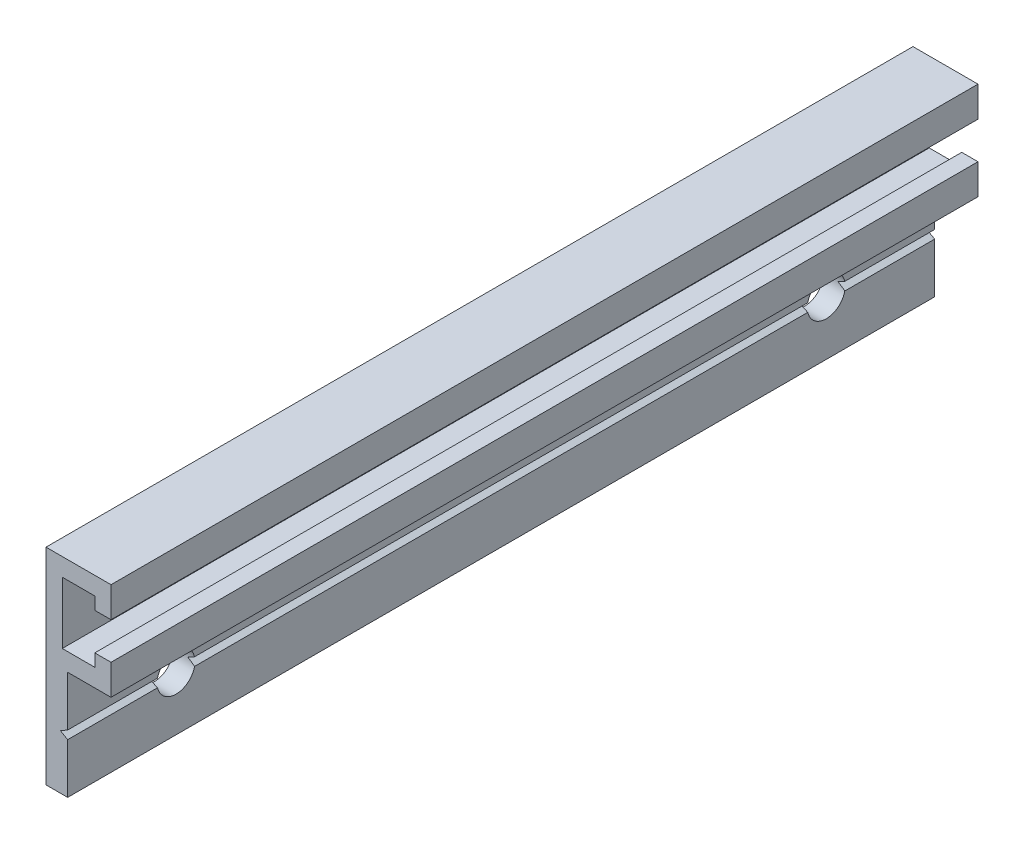
ISO-10303-21;
HEADER;
FILE_DESCRIPTION(('STEP AP214'),'2;1');
FILE_NAME('part.step','',(''),(''),'','','');
FILE_SCHEMA(('AUTOMOTIVE_DESIGN { 1 0 10303 214 1 1 1 1 }'));
ENDSEC;
DATA;
#1=APPLICATION_CONTEXT('core data for automotive mechanical design processes');
#2=APPLICATION_PROTOCOL_DEFINITION('international standard','automotive_design',2000,#1);
#3=PRODUCT_CONTEXT('',#1,'mechanical');
#4=PRODUCT('Part','Part','',(#3));
#5=PRODUCT_RELATED_PRODUCT_CATEGORY('part','',(#4));
#6=PRODUCT_DEFINITION_FORMATION('','',#4);
#7=PRODUCT_DEFINITION_CONTEXT('part definition',#1,'design');
#8=PRODUCT_DEFINITION('design','',#6,#7);
#9=PRODUCT_DEFINITION_SHAPE('','',#8);
#10=(LENGTH_UNIT() NAMED_UNIT(*) SI_UNIT(.MILLI.,.METRE.));
#11=(NAMED_UNIT(*) PLANE_ANGLE_UNIT() SI_UNIT($,.RADIAN.));
#12=(NAMED_UNIT(*) SI_UNIT($,.STERADIAN.) SOLID_ANGLE_UNIT());
#13=UNCERTAINTY_MEASURE_WITH_UNIT(LENGTH_MEASURE(1.E-05),#10,'distance_accuracy_value','');
#14=(GEOMETRIC_REPRESENTATION_CONTEXT(3) GLOBAL_UNCERTAINTY_ASSIGNED_CONTEXT((#13)) GLOBAL_UNIT_ASSIGNED_CONTEXT((#10,
#11,#12)) REPRESENTATION_CONTEXT('',''));
#15=CARTESIAN_POINT('',(0.,0.,0.));
#16=DIRECTION('',(0.,0.,1.));
#17=DIRECTION('',(1.,0.,0.));
#18=AXIS2_PLACEMENT_3D('',#15,#16,#17);
#19=CARTESIAN_POINT('',(1.99999999999999,-14.3845152792802,-80.));
#20=DIRECTION('',(0.5,0.866025403784439,0.));
#21=DIRECTION('',(-0.866025403784439,0.5,0.));
#22=AXIS2_PLACEMENT_3D('',#19,#20,#21);
#23=PLANE('',#22);
#24=CARTESIAN_POINT('',(1.33399999999999,-13.9999999999999,-10.));
#25=DIRECTION('',(0.5,0.866025403784439,0.));
#26=DIRECTION('',(-0.866025403784439,0.5,0.));
#27=AXIS2_PLACEMENT_3D('',#24,#25,#26);
#28=ELLIPSE('',#27,3.49999999999999,1.74999999999999);
#29=CARTESIAN_POINT('',(1.33399999999999,-14.,-8.25000000000001));
#30=VERTEX_POINT('',#29);
#31=CARTESIAN_POINT('',(1.99999999999999,-14.3845152792802,-8.29276597972041));
#32=VERTEX_POINT('',#31);
#33=EDGE_CURVE('E189',#30,#32,#28,.T.);
#34=ORIENTED_EDGE('',*,*,#33,.F.);
#35=DIRECTION('',(0.,0.,1.));
#36=VECTOR('',#35,1.);
#37=CARTESIAN_POINT('',(1.33399999999999,-14.,-80.));
#38=LINE('',#37,#36);
#39=CARTESIAN_POINT('',(1.33399999999999,-14.,0.));
#40=VERTEX_POINT('',#39);
#41=EDGE_CURVE('E200',#30,#40,#38,.T.);
#42=ORIENTED_EDGE('',*,*,#41,.T.);
#43=DIRECTION('',(-0.866025403784439,0.5,0.));
#44=VECTOR('',#43,1.);
#45=CARTESIAN_POINT('',(1.99999999999999,-14.3845152792802,0.));
#46=LINE('',#45,#44);
#47=CARTESIAN_POINT('',(1.99999999999999,-14.3845152792802,0.));
#48=VERTEX_POINT('',#47);
#49=EDGE_CURVE('E281',#48,#40,#46,.T.);
#50=ORIENTED_EDGE('',*,*,#49,.F.);
#51=DIRECTION('',(0.,0.,1.));
#52=VECTOR('',#51,1.);
#53=CARTESIAN_POINT('',(1.99999999999999,-14.3845152792802,-80.));
#54=LINE('',#53,#52);
#55=EDGE_CURVE('E202',#32,#48,#54,.T.);
#56=ORIENTED_EDGE('',*,*,#55,.F.);
#57=EDGE_LOOP('',(#34,#42,#50,#56));
#58=FACE_BOUND('',#57,.T.);
#59=ADVANCED_FACE('F34',(#58),#23,.T.);
#60=CARTESIAN_POINT('',(1.33399999999999,-14.,-80.));
#61=DIRECTION('',(0.5,-0.866025403784439,0.));
#62=DIRECTION('',(0.866025403784439,0.5,0.));
#63=AXIS2_PLACEMENT_3D('',#60,#61,#62);
#64=PLANE('',#63);
#65=CARTESIAN_POINT('',(1.334,-13.9999999999999,-10.));
#66=DIRECTION('',(0.5,-0.866025403784439,0.));
#67=DIRECTION('',(-0.866025403784439,-0.5,0.));
#68=AXIS2_PLACEMENT_3D('',#65,#66,#67);
#69=ELLIPSE('',#68,3.49999999999999,1.74999999999999);
#70=CARTESIAN_POINT('',(1.33399999999999,-14.,-11.75));
#71=VERTEX_POINT('',#70);
#72=CARTESIAN_POINT('',(1.99999999999999,-13.6154847207197,-11.7072340202796));
#73=VERTEX_POINT('',#72);
#74=EDGE_CURVE('E196',#71,#73,#69,.T.);
#75=ORIENTED_EDGE('',*,*,#74,.F.);
#76=CARTESIAN_POINT('',(1.33399999999999,-14.,-68.25));
#77=VERTEX_POINT('',#76);
#78=EDGE_CURVE('E209',#77,#71,#38,.T.);
#79=ORIENTED_EDGE('',*,*,#78,.F.);
#80=CARTESIAN_POINT('',(1.334,-13.9999999999999,-70.));
#81=DIRECTION('',(0.5,-0.866025403784439,0.));
#82=DIRECTION('',(-0.866025403784439,-0.5,0.));
#83=AXIS2_PLACEMENT_3D('',#80,#81,#82);
#84=ELLIPSE('',#83,3.49999999999999,1.74999999999999);
#85=CARTESIAN_POINT('',(1.99999999999999,-13.6154847207197,-68.2927659797204));
#86=VERTEX_POINT('',#85);
#87=EDGE_CURVE('E301',#86,#77,#84,.T.);
#88=ORIENTED_EDGE('',*,*,#87,.F.);
#89=DIRECTION('',(0.,0.,1.));
#90=VECTOR('',#89,1.);
#91=CARTESIAN_POINT('',(1.99999999999999,-13.6154847207197,-80.));
#92=LINE('',#91,#90);
#93=EDGE_CURVE('E222',#86,#73,#92,.T.);
#94=ORIENTED_EDGE('',*,*,#93,.T.);
#95=EDGE_LOOP('',(#75,#79,#88,#94));
#96=FACE_BOUND('',#95,.T.);
#97=ADVANCED_FACE('F419',(#96),#64,.T.);
#98=CARTESIAN_POINT('',(1.33399999999999,-14.,-71.75));
#99=VERTEX_POINT('',#98);
#100=CARTESIAN_POINT('',(1.99999999999999,-13.6154847207197,-71.7072340202796));
#101=VERTEX_POINT('',#100);
#102=EDGE_CURVE('E353',#99,#101,#84,.T.);
#103=ORIENTED_EDGE('',*,*,#102,.F.);
#104=CARTESIAN_POINT('',(1.33399999999999,-14.,-80.));
#105=VERTEX_POINT('',#104);
#106=EDGE_CURVE('E212',#105,#99,#38,.T.);
#107=ORIENTED_EDGE('',*,*,#106,.F.);
#108=DIRECTION('',(0.866025403784439,0.5,0.));
#109=VECTOR('',#108,1.);
#110=CARTESIAN_POINT('',(1.33399999999999,-14.,-80.));
#111=LINE('',#110,#109);
#112=CARTESIAN_POINT('',(1.99999999999999,-13.6154847207197,-80.));
#113=VERTEX_POINT('',#112);
#114=EDGE_CURVE('E329',#105,#113,#111,.T.);
#115=ORIENTED_EDGE('',*,*,#114,.T.);
#116=EDGE_CURVE('E223',#113,#101,#92,.T.);
#117=ORIENTED_EDGE('',*,*,#116,.T.);
#118=EDGE_LOOP('',(#103,#107,#115,#117));
#119=FACE_BOUND('',#118,.T.);
#120=ADVANCED_FACE('F451',(#119),#64,.T.);
#121=CARTESIAN_POINT('',(1.99999999999999,-14.3845152792802,-11.7072340202796));
#122=VERTEX_POINT('',#121);
#123=EDGE_CURVE('E204',#122,#71,#28,.T.);
#124=ORIENTED_EDGE('',*,*,#123,.F.);
#125=CARTESIAN_POINT('',(1.99999999999999,-14.3845152792802,-68.2927659797204));
#126=VERTEX_POINT('',#125);
#127=EDGE_CURVE('E215',#126,#122,#54,.T.);
#128=ORIENTED_EDGE('',*,*,#127,.F.);
#129=CARTESIAN_POINT('',(1.33399999999999,-13.9999999999999,-70.));
#130=DIRECTION('',(0.5,0.866025403784439,0.));
#131=DIRECTION('',(-0.866025403784439,0.5,0.));
#132=AXIS2_PLACEMENT_3D('',#129,#130,#131);
#133=ELLIPSE('',#132,3.49999999999999,1.74999999999999);
#134=EDGE_CURVE('E11',#77,#126,#133,.T.);
#135=ORIENTED_EDGE('',*,*,#134,.F.);
#136=ORIENTED_EDGE('',*,*,#78,.T.);
#137=EDGE_LOOP('',(#124,#128,#135,#136));
#138=FACE_BOUND('',#137,.T.);
#139=ADVANCED_FACE('F415',(#138),#23,.T.);
#140=CARTESIAN_POINT('',(4.50000000000002,-2.8,-80.));
#141=DIRECTION('',(0.,-1.,0.));
#142=DIRECTION('',(0.,0.,-1.));
#143=AXIS2_PLACEMENT_3D('',#140,#141,#142);
#144=PLANE('',#143);
#145=DIRECTION('',(1.,0.,0.));
#146=VECTOR('',#145,1.);
#147=CARTESIAN_POINT('',(4.50000000000002,-2.8,0.));
#148=LINE('',#147,#146);
#149=CARTESIAN_POINT('',(4.50000000000002,-2.8,0.));
#150=VERTEX_POINT('',#149);
#151=CARTESIAN_POINT('',(6.00000000000001,-2.8,0.));
#152=VERTEX_POINT('',#151);
#153=EDGE_CURVE('E298',#150,#152,#148,.T.);
#154=ORIENTED_EDGE('',*,*,#153,.F.);
#155=DIRECTION('',(0.,0.,1.));
#156=VECTOR('',#155,1.);
#157=CARTESIAN_POINT('',(4.50000000000002,-2.8,-80.));
#158=LINE('',#157,#156);
#159=CARTESIAN_POINT('',(4.50000000000002,-2.8,-80.));
#160=VERTEX_POINT('',#159);
#161=EDGE_CURVE('E250',#160,#150,#158,.T.);
#162=ORIENTED_EDGE('',*,*,#161,.F.);
#163=DIRECTION('',(1.,0.,0.));
#164=VECTOR('',#163,1.);
#165=CARTESIAN_POINT('',(4.50000000000002,-2.8,-80.));
#166=LINE('',#165,#164);
#167=CARTESIAN_POINT('',(6.00000000000001,-2.8,-80.));
#168=VERTEX_POINT('',#167);
#169=EDGE_CURVE('E255',#160,#168,#166,.T.);
#170=ORIENTED_EDGE('',*,*,#169,.T.);
#171=DIRECTION('',(0.,0.,1.));
#172=VECTOR('',#171,1.);
#173=CARTESIAN_POINT('',(6.00000000000001,-2.8,-80.));
#174=LINE('',#173,#172);
#175=EDGE_CURVE('E305',#168,#152,#174,.T.);
#176=ORIENTED_EDGE('',*,*,#175,.T.);
#177=EDGE_LOOP('',(#154,#162,#170,#176));
#178=FACE_BOUND('',#177,.T.);
#179=ADVANCED_FACE('F36',(#178),#144,.T.);
#180=CARTESIAN_POINT('',(4.50000000000002,-1.65,-80.));
#181=DIRECTION('',(-1.,0.,0.));
#182=DIRECTION('',(0.,0.,1.));
#183=AXIS2_PLACEMENT_3D('',#180,#181,#182);
#184=PLANE('',#183);
#185=DIRECTION('',(0.,-1.,0.));
#186=VECTOR('',#185,1.);
#187=CARTESIAN_POINT('',(4.50000000000002,-1.65,0.));
#188=LINE('',#187,#186);
#189=CARTESIAN_POINT('',(4.50000000000002,-1.65,0.));
#190=VERTEX_POINT('',#189);
#191=EDGE_CURVE('E252',#190,#150,#188,.T.);
#192=ORIENTED_EDGE('',*,*,#191,.F.);
#193=DIRECTION('',(0.,0.,1.));
#194=VECTOR('',#193,1.);
#195=CARTESIAN_POINT('',(4.50000000000002,-1.65,-80.));
#196=LINE('',#195,#194);
#197=CARTESIAN_POINT('',(4.50000000000002,-1.65,-80.));
#198=VERTEX_POINT('',#197);
#199=EDGE_CURVE('E248',#198,#190,#196,.T.);
#200=ORIENTED_EDGE('',*,*,#199,.F.);
#201=DIRECTION('',(0.,-1.,0.));
#202=VECTOR('',#201,1.);
#203=CARTESIAN_POINT('',(4.50000000000002,-1.65,-80.));
#204=LINE('',#203,#202);
#205=EDGE_CURVE('E302',#198,#160,#204,.T.);
#206=ORIENTED_EDGE('',*,*,#205,.T.);
#207=ORIENTED_EDGE('',*,*,#161,.T.);
#208=EDGE_LOOP('',(#192,#200,#206,#207));
#209=FACE_BOUND('',#208,.T.);
#210=ADVANCED_FACE('F398',(#209),#184,.T.);
#211=CARTESIAN_POINT('',(1.50000000000001,-1.65,-80.));
#212=DIRECTION('',(0.,-1.,0.));
#213=DIRECTION('',(0.,0.,-1.));
#214=AXIS2_PLACEMENT_3D('',#211,#212,#213);
#215=PLANE('',#214);
#216=DIRECTION('',(1.,0.,0.));
#217=VECTOR('',#216,1.);
#218=CARTESIAN_POINT('',(1.50000000000001,-1.65,0.));
#219=LINE('',#218,#217);
#220=CARTESIAN_POINT('',(1.50000000000001,-1.65,0.));
#221=VERTEX_POINT('',#220);
#222=EDGE_CURVE('E256',#221,#190,#219,.T.);
#223=ORIENTED_EDGE('',*,*,#222,.F.);
#224=DIRECTION('',(0.,0.,1.));
#225=VECTOR('',#224,1.);
#226=CARTESIAN_POINT('',(1.50000000000001,-1.65,-80.));
#227=LINE('',#226,#225);
#228=CARTESIAN_POINT('',(1.50000000000001,-1.65,-80.));
#229=VERTEX_POINT('',#228);
#230=EDGE_CURVE('E246',#229,#221,#227,.T.);
#231=ORIENTED_EDGE('',*,*,#230,.F.);
#232=DIRECTION('',(1.,0.,0.));
#233=VECTOR('',#232,1.);
#234=CARTESIAN_POINT('',(1.50000000000001,-1.65,-80.));
#235=LINE('',#234,#233);
#236=EDGE_CURVE('E306',#229,#198,#235,.T.);
#237=ORIENTED_EDGE('',*,*,#236,.T.);
#238=ORIENTED_EDGE('',*,*,#199,.T.);
#239=EDGE_LOOP('',(#223,#231,#237,#238));
#240=FACE_BOUND('',#239,.T.);
#241=ADVANCED_FACE('F448',(#240),#215,.T.);
#242=CARTESIAN_POINT('',(1.50000000000001,-7.35,-80.));
#243=DIRECTION('',(1.,0.,0.));
#244=DIRECTION('',(0.,0.,-1.));
#245=AXIS2_PLACEMENT_3D('',#242,#243,#244);
#246=PLANE('',#245);
#247=DIRECTION('',(0.,1.,0.));
#248=VECTOR('',#247,1.);
#249=CARTESIAN_POINT('',(1.50000000000001,-7.35,0.));
#250=LINE('',#249,#248);
#251=CARTESIAN_POINT('',(1.50000000000001,-7.35,0.));
#252=VERTEX_POINT('',#251);
#253=EDGE_CURVE('E259',#252,#221,#250,.T.);
#254=ORIENTED_EDGE('',*,*,#253,.F.);
#255=DIRECTION('',(0.,0.,1.));
#256=VECTOR('',#255,1.);
#257=CARTESIAN_POINT('',(1.50000000000001,-7.35,-80.));
#258=LINE('',#257,#256);
#259=CARTESIAN_POINT('',(1.50000000000001,-7.35,-80.));
#260=VERTEX_POINT('',#259);
#261=EDGE_CURVE('E244',#260,#252,#258,.T.);
#262=ORIENTED_EDGE('',*,*,#261,.F.);
#263=DIRECTION('',(0.,1.,0.));
#264=VECTOR('',#263,1.);
#265=CARTESIAN_POINT('',(1.50000000000001,-7.35,-80.));
#266=LINE('',#265,#264);
#267=EDGE_CURVE('E309',#260,#229,#266,.T.);
#268=ORIENTED_EDGE('',*,*,#267,.T.);
#269=ORIENTED_EDGE('',*,*,#230,.T.);
#270=EDGE_LOOP('',(#254,#262,#268,#269));
#271=FACE_BOUND('',#270,.T.);
#272=ADVANCED_FACE('F446',(#271),#246,.T.);
#273=CARTESIAN_POINT('',(4.50000000000002,-7.35,-80.));
#274=DIRECTION('',(0.,1.,0.));
#275=DIRECTION('',(0.,0.,1.));
#276=AXIS2_PLACEMENT_3D('',#273,#274,#275);
#277=PLANE('',#276);
#278=DIRECTION('',(-1.,0.,0.));
#279=VECTOR('',#278,1.);
#280=CARTESIAN_POINT('',(4.50000000000002,-7.35,0.));
#281=LINE('',#280,#279);
#282=CARTESIAN_POINT('',(4.50000000000002,-7.35,0.));
#283=VERTEX_POINT('',#282);
#284=EDGE_CURVE('E262',#283,#252,#281,.T.);
#285=ORIENTED_EDGE('',*,*,#284,.F.);
#286=DIRECTION('',(0.,0.,1.));
#287=VECTOR('',#286,1.);
#288=CARTESIAN_POINT('',(4.50000000000002,-7.35,-80.));
#289=LINE('',#288,#287);
#290=CARTESIAN_POINT('',(4.50000000000002,-7.35,-80.));
#291=VERTEX_POINT('',#290);
#292=EDGE_CURVE('E242',#291,#283,#289,.T.);
#293=ORIENTED_EDGE('',*,*,#292,.F.);
#294=DIRECTION('',(-1.,0.,0.));
#295=VECTOR('',#294,1.);
#296=CARTESIAN_POINT('',(4.50000000000002,-7.35,-80.));
#297=LINE('',#296,#295);
#298=EDGE_CURVE('E312',#291,#260,#297,.T.);
#299=ORIENTED_EDGE('',*,*,#298,.T.);
#300=ORIENTED_EDGE('',*,*,#261,.T.);
#301=EDGE_LOOP('',(#285,#293,#299,#300));
#302=FACE_BOUND('',#301,.T.);
#303=ADVANCED_FACE('F442',(#302),#277,.T.);
#304=CARTESIAN_POINT('',(4.50000000000002,-6.2,-80.));
#305=DIRECTION('',(-1.,0.,0.));
#306=DIRECTION('',(0.,0.,1.));
#307=AXIS2_PLACEMENT_3D('',#304,#305,#306);
#308=PLANE('',#307);
#309=DIRECTION('',(0.,-1.,0.));
#310=VECTOR('',#309,1.);
#311=CARTESIAN_POINT('',(4.50000000000002,-6.2,0.));
#312=LINE('',#311,#310);
#313=CARTESIAN_POINT('',(4.50000000000002,-6.2,0.));
#314=VERTEX_POINT('',#313);
#315=EDGE_CURVE('E265',#314,#283,#312,.T.);
#316=ORIENTED_EDGE('',*,*,#315,.F.);
#317=DIRECTION('',(0.,0.,1.));
#318=VECTOR('',#317,1.);
#319=CARTESIAN_POINT('',(4.50000000000002,-6.2,-80.));
#320=LINE('',#319,#318);
#321=CARTESIAN_POINT('',(4.50000000000002,-6.2,-80.));
#322=VERTEX_POINT('',#321);
#323=EDGE_CURVE('E240',#322,#314,#320,.T.);
#324=ORIENTED_EDGE('',*,*,#323,.F.);
#325=DIRECTION('',(0.,-1.,0.));
#326=VECTOR('',#325,1.);
#327=CARTESIAN_POINT('',(4.50000000000002,-6.2,-80.));
#328=LINE('',#327,#326);
#329=EDGE_CURVE('E315',#322,#291,#328,.T.);
#330=ORIENTED_EDGE('',*,*,#329,.T.);
#331=ORIENTED_EDGE('',*,*,#292,.T.);
#332=EDGE_LOOP('',(#316,#324,#330,#331));
#333=FACE_BOUND('',#332,.T.);
#334=ADVANCED_FACE('F438',(#333),#308,.T.);
#335=CARTESIAN_POINT('',(6.00000000000001,-6.2,-80.));
#336=DIRECTION('',(0.,1.,0.));
#337=DIRECTION('',(0.,0.,1.));
#338=AXIS2_PLACEMENT_3D('',#335,#336,#337);
#339=PLANE('',#338);
#340=DIRECTION('',(-1.,0.,0.));
#341=VECTOR('',#340,1.);
#342=CARTESIAN_POINT('',(6.00000000000001,-6.2,0.));
#343=LINE('',#342,#341);
#344=CARTESIAN_POINT('',(6.00000000000001,-6.2,0.));
#345=VERTEX_POINT('',#344);
#346=EDGE_CURVE('E268',#345,#314,#343,.T.);
#347=ORIENTED_EDGE('',*,*,#346,.F.);
#348=DIRECTION('',(0.,0.,1.));
#349=VECTOR('',#348,1.);
#350=CARTESIAN_POINT('',(6.00000000000001,-6.2,-80.));
#351=LINE('',#350,#349);
#352=CARTESIAN_POINT('',(6.00000000000001,-6.2,-80.));
#353=VERTEX_POINT('',#352);
#354=EDGE_CURVE('E236',#353,#345,#351,.T.);
#355=ORIENTED_EDGE('',*,*,#354,.F.);
#356=DIRECTION('',(-1.,0.,0.));
#357=VECTOR('',#356,1.);
#358=CARTESIAN_POINT('',(6.00000000000001,-6.2,-80.));
#359=LINE('',#358,#357);
#360=EDGE_CURVE('E318',#353,#322,#359,.T.);
#361=ORIENTED_EDGE('',*,*,#360,.T.);
#362=ORIENTED_EDGE('',*,*,#323,.T.);
#363=EDGE_LOOP('',(#347,#355,#361,#362));
#364=FACE_BOUND('',#363,.T.);
#365=ADVANCED_FACE('F434',(#364),#339,.T.);
#366=CARTESIAN_POINT('',(6.00000000000001,-9.,-80.));
#367=DIRECTION('',(1.,0.,0.));
#368=DIRECTION('',(0.,1.,0.));
#369=AXIS2_PLACEMENT_3D('',#366,#367,#368);
#370=PLANE('',#369);
#371=DIRECTION('',(0.,1.,0.));
#372=VECTOR('',#371,1.);
#373=CARTESIAN_POINT('',(6.00000000000001,-9.,0.));
#374=LINE('',#373,#372);
#375=CARTESIAN_POINT('',(6.00000000000001,-9.,0.));
#376=VERTEX_POINT('',#375);
#377=EDGE_CURVE('E271',#376,#345,#374,.T.);
#378=ORIENTED_EDGE('',*,*,#377,.F.);
#379=DIRECTION('',(0.,0.,1.));
#380=VECTOR('',#379,1.);
#381=CARTESIAN_POINT('',(6.00000000000001,-9.,-80.));
#382=LINE('',#381,#380);
#383=CARTESIAN_POINT('',(6.00000000000001,-9.,-80.));
#384=VERTEX_POINT('',#383);
#385=EDGE_CURVE('E232',#384,#376,#382,.T.);
#386=ORIENTED_EDGE('',*,*,#385,.F.);
#387=DIRECTION('',(0.,1.,0.));
#388=VECTOR('',#387,1.);
#389=CARTESIAN_POINT('',(6.00000000000001,-9.,-80.));
#390=LINE('',#389,#388);
#391=EDGE_CURVE('E321',#384,#353,#390,.T.);
#392=ORIENTED_EDGE('',*,*,#391,.T.);
#393=ORIENTED_EDGE('',*,*,#354,.T.);
#394=EDGE_LOOP('',(#378,#386,#392,#393));
#395=FACE_BOUND('',#394,.T.);
#396=ADVANCED_FACE('F430',(#395),#370,.T.);
#397=CARTESIAN_POINT('',(1.99999999999999,-9.,-80.));
#398=DIRECTION('',(0.,-1.,0.));
#399=DIRECTION('',(0.,0.,-1.));
#400=AXIS2_PLACEMENT_3D('',#397,#398,#399);
#401=PLANE('',#400);
#402=DIRECTION('',(1.,0.,0.));
#403=VECTOR('',#402,1.);
#404=CARTESIAN_POINT('',(1.99999999999999,-9.,0.));
#405=LINE('',#404,#403);
#406=CARTESIAN_POINT('',(1.99999999999999,-9.,0.));
#407=VERTEX_POINT('',#406);
#408=EDGE_CURVE('E274',#407,#376,#405,.T.);
#409=ORIENTED_EDGE('',*,*,#408,.F.);
#410=DIRECTION('',(0.,0.,1.));
#411=VECTOR('',#410,1.);
#412=CARTESIAN_POINT('',(1.99999999999999,-9.,-80.));
#413=LINE('',#412,#411);
#414=CARTESIAN_POINT('',(1.99999999999999,-9.,-80.));
#415=VERTEX_POINT('',#414);
#416=EDGE_CURVE('E228',#415,#407,#413,.T.);
#417=ORIENTED_EDGE('',*,*,#416,.F.);
#418=DIRECTION('',(1.,0.,0.));
#419=VECTOR('',#418,1.);
#420=CARTESIAN_POINT('',(1.99999999999999,-9.,-80.));
#421=LINE('',#420,#419);
#422=EDGE_CURVE('E324',#415,#384,#421,.T.);
#423=ORIENTED_EDGE('',*,*,#422,.T.);
#424=ORIENTED_EDGE('',*,*,#385,.T.);
#425=EDGE_LOOP('',(#409,#417,#423,#424));
#426=FACE_BOUND('',#425,.T.);
#427=ADVANCED_FACE('F426',(#426),#401,.T.);
#428=CARTESIAN_POINT('',(1.99999999999999,-13.6154847207197,-80.));
#429=DIRECTION('',(1.,0.,0.));
#430=DIRECTION('',(0.,1.,0.));
#431=AXIS2_PLACEMENT_3D('',#428,#429,#430);
#432=PLANE('',#431);
#433=CARTESIAN_POINT('',(1.99999999999999,-13.9999999999999,-10.));
#434=DIRECTION('',(1.,0.,0.));
#435=DIRECTION('',(0.,1.,0.));
#436=AXIS2_PLACEMENT_3D('',#433,#434,#435);
#437=CIRCLE('',#436,1.74999999999999);
#438=CARTESIAN_POINT('',(1.99999999999999,-13.6154847207197,-8.29276597972041));
#439=VERTEX_POINT('',#438);
#440=EDGE_CURVE('E49',#73,#439,#437,.T.);
#441=ORIENTED_EDGE('',*,*,#440,.F.);
#442=ORIENTED_EDGE('',*,*,#93,.F.);
#443=CARTESIAN_POINT('',(1.99999999999999,-13.9999999999999,-70.));
#444=DIRECTION('',(1.,0.,0.));
#445=DIRECTION('',(0.,1.,0.));
#446=AXIS2_PLACEMENT_3D('',#443,#444,#445);
#447=CIRCLE('',#446,1.74999999999999);
#448=EDGE_CURVE('E350',#101,#86,#447,.T.);
#449=ORIENTED_EDGE('',*,*,#448,.F.);
#450=ORIENTED_EDGE('',*,*,#116,.F.);
#451=DIRECTION('',(0.,1.,0.));
#452=VECTOR('',#451,1.);
#453=CARTESIAN_POINT('',(1.99999999999999,-13.6154847207197,-80.));
#454=LINE('',#453,#452);
#455=EDGE_CURVE('E327',#113,#415,#454,.T.);
#456=ORIENTED_EDGE('',*,*,#455,.T.);
#457=ORIENTED_EDGE('',*,*,#416,.T.);
#458=DIRECTION('',(0.,1.,0.));
#459=VECTOR('',#458,1.);
#460=CARTESIAN_POINT('',(1.99999999999999,-13.6154847207197,0.));
#461=LINE('',#460,#459);
#462=CARTESIAN_POINT('',(1.99999999999999,-13.6154847207197,0.));
#463=VERTEX_POINT('',#462);
#464=EDGE_CURVE('E277',#463,#407,#461,.T.);
#465=ORIENTED_EDGE('',*,*,#464,.F.);
#466=EDGE_CURVE('E219',#439,#463,#92,.T.);
#467=ORIENTED_EDGE('',*,*,#466,.F.);
#468=EDGE_LOOP('',(#441,#442,#449,#450,#456,#457,#465,#467));
#469=FACE_BOUND('',#468,.T.);
#470=ADVANCED_FACE('F423',(#469),#432,.T.);
#471=EDGE_CURVE('E185',#439,#30,#69,.T.);
#472=ORIENTED_EDGE('',*,*,#471,.F.);
#473=ORIENTED_EDGE('',*,*,#466,.T.);
#474=DIRECTION('',(0.866025403784439,0.5,0.));
#475=VECTOR('',#474,1.);
#476=CARTESIAN_POINT('',(1.33399999999999,-14.,0.));
#477=LINE('',#476,#475);
#478=EDGE_CURVE('E207',#40,#463,#477,.T.);
#479=ORIENTED_EDGE('',*,*,#478,.F.);
#480=ORIENTED_EDGE('',*,*,#41,.F.);
#481=EDGE_LOOP('',(#472,#473,#479,#480));
#482=FACE_BOUND('',#481,.T.);
#483=ADVANCED_FACE('F205',(#482),#64,.T.);
#484=CARTESIAN_POINT('',(1.99999999999999,-14.3845152792802,-71.7072340202796));
#485=VERTEX_POINT('',#484);
#486=EDGE_CURVE('E38',#485,#99,#133,.T.);
#487=ORIENTED_EDGE('',*,*,#486,.F.);
#488=CARTESIAN_POINT('',(1.99999999999999,-14.3845152792802,-80.));
#489=VERTEX_POINT('',#488);
#490=EDGE_CURVE('E210',#489,#485,#54,.T.);
#491=ORIENTED_EDGE('',*,*,#490,.F.);
#492=DIRECTION('',(-0.866025403784439,0.5,0.));
#493=VECTOR('',#492,1.);
#494=CARTESIAN_POINT('',(1.99999999999999,-14.3845152792802,-80.));
#495=LINE('',#494,#493);
#496=EDGE_CURVE('E331',#489,#105,#495,.T.);
#497=ORIENTED_EDGE('',*,*,#496,.T.);
#498=ORIENTED_EDGE('',*,*,#106,.T.);
#499=EDGE_LOOP('',(#487,#491,#497,#498));
#500=FACE_BOUND('',#499,.T.);
#501=ADVANCED_FACE('F454',(#500),#23,.T.);
#502=CARTESIAN_POINT('',(2.,-19.,-80.));
#503=DIRECTION('',(1.,0.,0.));
#504=DIRECTION('',(0.,1.,0.));
#505=AXIS2_PLACEMENT_3D('',#502,#503,#504);
#506=PLANE('',#505);
#507=CARTESIAN_POINT('',(1.99999999999999,-13.9999999999999,-10.));
#508=DIRECTION('',(1.,0.,0.));
#509=DIRECTION('',(0.,1.,0.));
#510=AXIS2_PLACEMENT_3D('',#507,#508,#509);
#511=CIRCLE('',#510,1.74999999999999);
#512=EDGE_CURVE('E358',#32,#122,#511,.T.);
#513=ORIENTED_EDGE('',*,*,#512,.F.);
#514=ORIENTED_EDGE('',*,*,#55,.T.);
#515=DIRECTION('',(0.,1.,0.));
#516=VECTOR('',#515,1.);
#517=CARTESIAN_POINT('',(2.,-19.,0.));
#518=LINE('',#517,#516);
#519=CARTESIAN_POINT('',(2.,-19.,0.));
#520=VERTEX_POINT('',#519);
#521=EDGE_CURVE('E283',#520,#48,#518,.T.);
#522=ORIENTED_EDGE('',*,*,#521,.F.);
#523=DIRECTION('',(0.,0.,1.));
#524=VECTOR('',#523,1.);
#525=CARTESIAN_POINT('',(2.,-19.,-80.));
#526=LINE('',#525,#524);
#527=CARTESIAN_POINT('',(2.,-19.,-80.));
#528=VERTEX_POINT('',#527);
#529=EDGE_CURVE('E385',#528,#520,#526,.T.);
#530=ORIENTED_EDGE('',*,*,#529,.F.);
#531=DIRECTION('',(0.,1.,0.));
#532=VECTOR('',#531,1.);
#533=CARTESIAN_POINT('',(2.,-19.,-80.));
#534=LINE('',#533,#532);
#535=EDGE_CURVE('E333',#528,#489,#534,.T.);
#536=ORIENTED_EDGE('',*,*,#535,.T.);
#537=ORIENTED_EDGE('',*,*,#490,.T.);
#538=CARTESIAN_POINT('',(1.99999999999999,-13.9999999999999,-70.));
#539=DIRECTION('',(1.,0.,0.));
#540=DIRECTION('',(0.,1.,0.));
#541=AXIS2_PLACEMENT_3D('',#538,#539,#540);
#542=CIRCLE('',#541,1.74999999999999);
#543=EDGE_CURVE('E56',#126,#485,#542,.T.);
#544=ORIENTED_EDGE('',*,*,#543,.F.);
#545=ORIENTED_EDGE('',*,*,#127,.T.);
#546=EDGE_LOOP('',(#513,#514,#522,#530,#536,#537,#544,#545));
#547=FACE_BOUND('',#546,.T.);
#548=ADVANCED_FACE('F409',(#547),#506,.T.);
#549=CARTESIAN_POINT('',(0.,-19.,-80.));
#550=DIRECTION('',(0.,-1.,0.));
#551=DIRECTION('',(0.,0.,-1.));
#552=AXIS2_PLACEMENT_3D('',#549,#550,#551);
#553=PLANE('',#552);
#554=DIRECTION('',(1.,0.,0.));
#555=VECTOR('',#554,1.);
#556=CARTESIAN_POINT('',(0.,-19.,0.));
#557=LINE('',#556,#555);
#558=CARTESIAN_POINT('',(0.,-19.,0.));
#559=VERTEX_POINT('',#558);
#560=EDGE_CURVE('E286',#559,#520,#557,.T.);
#561=ORIENTED_EDGE('',*,*,#560,.F.);
#562=DIRECTION('',(0.,0.,1.));
#563=VECTOR('',#562,1.);
#564=CARTESIAN_POINT('',(0.,-19.,-80.));
#565=LINE('',#564,#563);
#566=CARTESIAN_POINT('',(0.,-19.,-80.));
#567=VERTEX_POINT('',#566);
#568=EDGE_CURVE('E375',#567,#559,#565,.T.);
#569=ORIENTED_EDGE('',*,*,#568,.F.);
#570=DIRECTION('',(1.,0.,0.));
#571=VECTOR('',#570,1.);
#572=CARTESIAN_POINT('',(0.,-19.,-80.));
#573=LINE('',#572,#571);
#574=EDGE_CURVE('E336',#567,#528,#573,.T.);
#575=ORIENTED_EDGE('',*,*,#574,.T.);
#576=ORIENTED_EDGE('',*,*,#529,.T.);
#577=EDGE_LOOP('',(#561,#569,#575,#576));
#578=FACE_BOUND('',#577,.T.);
#579=ADVANCED_FACE('F368',(#578),#553,.T.);
#580=CARTESIAN_POINT('',(0.,0.,-80.));
#581=DIRECTION('',(-1.,0.,0.));
#582=DIRECTION('',(0.,-1.,0.));
#583=AXIS2_PLACEMENT_3D('',#580,#581,#582);
#584=PLANE('',#583);
#585=CARTESIAN_POINT('',(0.,-13.9999999999999,-10.));
#586=DIRECTION('',(-1.,0.,0.));
#587=DIRECTION('',(0.,0.,1.));
#588=AXIS2_PLACEMENT_3D('',#585,#586,#587);
#589=CIRCLE('',#588,1.74999999999999);
#590=CARTESIAN_POINT('',(0.,-13.9999999999999,-8.25000000000001));
#591=VERTEX_POINT('',#590);
#592=EDGE_CURVE('E194',#591,#591,#589,.T.);
#593=ORIENTED_EDGE('',*,*,#592,.F.);
#594=EDGE_LOOP('',(#593));
#595=FACE_BOUND('',#594,.T.);
#596=CARTESIAN_POINT('',(0.,-13.9999999999999,-70.));
#597=DIRECTION('',(-1.,0.,0.));
#598=DIRECTION('',(0.,0.,1.));
#599=AXIS2_PLACEMENT_3D('',#596,#597,#598);
#600=CIRCLE('',#599,1.74999999999999);
#601=CARTESIAN_POINT('',(0.,-13.9999999999999,-68.25));
#602=VERTEX_POINT('',#601);
#603=EDGE_CURVE('E355',#602,#602,#600,.T.);
#604=ORIENTED_EDGE('',*,*,#603,.F.);
#605=EDGE_LOOP('',(#604));
#606=FACE_BOUND('',#605,.T.);
#607=DIRECTION('',(0.,-1.,0.));
#608=VECTOR('',#607,1.);
#609=CARTESIAN_POINT('',(0.,0.,0.));
#610=LINE('',#609,#608);
#611=CARTESIAN_POINT('',(0.,0.,0.));
#612=VERTEX_POINT('',#611);
#613=EDGE_CURVE('E289',#612,#559,#610,.T.);
#614=ORIENTED_EDGE('',*,*,#613,.F.);
#615=DIRECTION('',(0.,0.,1.));
#616=VECTOR('',#615,1.);
#617=CARTESIAN_POINT('',(0.,0.,-80.));
#618=LINE('',#617,#616);
#619=CARTESIAN_POINT('',(0.,0.,-80.));
#620=VERTEX_POINT('',#619);
#621=EDGE_CURVE('E373',#620,#612,#618,.T.);
#622=ORIENTED_EDGE('',*,*,#621,.F.);
#623=DIRECTION('',(0.,-1.,0.));
#624=VECTOR('',#623,1.);
#625=CARTESIAN_POINT('',(0.,0.,-80.));
#626=LINE('',#625,#624);
#627=EDGE_CURVE('E339',#620,#567,#626,.T.);
#628=ORIENTED_EDGE('',*,*,#627,.T.);
#629=ORIENTED_EDGE('',*,*,#568,.T.);
#630=EDGE_LOOP('',(#614,#622,#628,#629));
#631=FACE_BOUND('',#630,.T.);
#632=ADVANCED_FACE('F364',(#595,#606,#631),#584,.T.);
#633=CARTESIAN_POINT('',(6.00000000000001,0.,-80.));
#634=DIRECTION('',(0.,1.,0.));
#635=DIRECTION('',(0.,0.,1.));
#636=AXIS2_PLACEMENT_3D('',#633,#634,#635);
#637=PLANE('',#636);
#638=DIRECTION('',(-1.,0.,0.));
#639=VECTOR('',#638,1.);
#640=CARTESIAN_POINT('',(6.00000000000001,0.,0.));
#641=LINE('',#640,#639);
#642=CARTESIAN_POINT('',(6.00000000000001,0.,0.));
#643=VERTEX_POINT('',#642);
#644=EDGE_CURVE('E292',#643,#612,#641,.T.);
#645=ORIENTED_EDGE('',*,*,#644,.F.);
#646=DIRECTION('',(0.,0.,1.));
#647=VECTOR('',#646,1.);
#648=CARTESIAN_POINT('',(6.00000000000001,0.,-80.));
#649=LINE('',#648,#647);
#650=CARTESIAN_POINT('',(6.00000000000001,0.,-80.));
#651=VERTEX_POINT('',#650);
#652=EDGE_CURVE('E382',#651,#643,#649,.T.);
#653=ORIENTED_EDGE('',*,*,#652,.F.);
#654=DIRECTION('',(-1.,0.,0.));
#655=VECTOR('',#654,1.);
#656=CARTESIAN_POINT('',(6.00000000000001,0.,-80.));
#657=LINE('',#656,#655);
#658=EDGE_CURVE('E342',#651,#620,#657,.T.);
#659=ORIENTED_EDGE('',*,*,#658,.T.);
#660=ORIENTED_EDGE('',*,*,#621,.T.);
#661=EDGE_LOOP('',(#645,#653,#659,#660));
#662=FACE_BOUND('',#661,.T.);
#663=ADVANCED_FACE('F367',(#662),#637,.T.);
#664=CARTESIAN_POINT('',(6.00000000000001,-2.8,-80.));
#665=DIRECTION('',(1.,0.,0.));
#666=DIRECTION('',(0.,1.,0.));
#667=AXIS2_PLACEMENT_3D('',#664,#665,#666);
#668=PLANE('',#667);
#669=DIRECTION('',(0.,1.,0.));
#670=VECTOR('',#669,1.);
#671=CARTESIAN_POINT('',(6.00000000000001,-2.8,0.));
#672=LINE('',#671,#670);
#673=EDGE_CURVE('E295',#152,#643,#672,.T.);
#674=ORIENTED_EDGE('',*,*,#673,.F.);
#675=ORIENTED_EDGE('',*,*,#175,.F.);
#676=DIRECTION('',(0.,1.,0.));
#677=VECTOR('',#676,1.);
#678=CARTESIAN_POINT('',(6.00000000000001,-2.8,-80.));
#679=LINE('',#678,#677);
#680=EDGE_CURVE('E345',#168,#651,#679,.T.);
#681=ORIENTED_EDGE('',*,*,#680,.T.);
#682=ORIENTED_EDGE('',*,*,#652,.T.);
#683=EDGE_LOOP('',(#674,#675,#681,#682));
#684=FACE_BOUND('',#683,.T.);
#685=ADVANCED_FACE('F394',(#684),#668,.T.);
#686=CARTESIAN_POINT('',(6.00000000000001,-2.8,-80.));
#687=DIRECTION('',(0.,0.,1.));
#688=DIRECTION('',(1.,0.,0.));
#689=AXIS2_PLACEMENT_3D('',#686,#687,#688);
#690=PLANE('',#689);
#691=ORIENTED_EDGE('',*,*,#169,.F.);
#692=ORIENTED_EDGE('',*,*,#205,.F.);
#693=ORIENTED_EDGE('',*,*,#236,.F.);
#694=ORIENTED_EDGE('',*,*,#267,.F.);
#695=ORIENTED_EDGE('',*,*,#298,.F.);
#696=ORIENTED_EDGE('',*,*,#329,.F.);
#697=ORIENTED_EDGE('',*,*,#360,.F.);
#698=ORIENTED_EDGE('',*,*,#391,.F.);
#699=ORIENTED_EDGE('',*,*,#422,.F.);
#700=ORIENTED_EDGE('',*,*,#455,.F.);
#701=ORIENTED_EDGE('',*,*,#114,.F.);
#702=ORIENTED_EDGE('',*,*,#496,.F.);
#703=ORIENTED_EDGE('',*,*,#535,.F.);
#704=ORIENTED_EDGE('',*,*,#574,.F.);
#705=ORIENTED_EDGE('',*,*,#627,.F.);
#706=ORIENTED_EDGE('',*,*,#658,.F.);
#707=ORIENTED_EDGE('',*,*,#680,.F.);
#708=EDGE_LOOP('',(#691,#692,#693,#694,#695,#696,#697,#698,#699,#700,#701,#702,#703,#704,#705,
#706,#707));
#709=FACE_BOUND('',#708,.T.);
#710=ADVANCED_FACE('F401',(#709),#690,.F.);
#711=CARTESIAN_POINT('',(6.00000000000001,-2.8,0.));
#712=DIRECTION('',(0.,0.,1.));
#713=DIRECTION('',(1.,0.,0.));
#714=AXIS2_PLACEMENT_3D('',#711,#712,#713);
#715=PLANE('',#714);
#716=ORIENTED_EDGE('',*,*,#153,.T.);
#717=ORIENTED_EDGE('',*,*,#673,.T.);
#718=ORIENTED_EDGE('',*,*,#644,.T.);
#719=ORIENTED_EDGE('',*,*,#613,.T.);
#720=ORIENTED_EDGE('',*,*,#560,.T.);
#721=ORIENTED_EDGE('',*,*,#521,.T.);
#722=ORIENTED_EDGE('',*,*,#49,.T.);
#723=ORIENTED_EDGE('',*,*,#478,.T.);
#724=ORIENTED_EDGE('',*,*,#464,.T.);
#725=ORIENTED_EDGE('',*,*,#408,.T.);
#726=ORIENTED_EDGE('',*,*,#377,.T.);
#727=ORIENTED_EDGE('',*,*,#346,.T.);
#728=ORIENTED_EDGE('',*,*,#315,.T.);
#729=ORIENTED_EDGE('',*,*,#284,.T.);
#730=ORIENTED_EDGE('',*,*,#253,.T.);
#731=ORIENTED_EDGE('',*,*,#222,.T.);
#732=ORIENTED_EDGE('',*,*,#191,.T.);
#733=EDGE_LOOP('',(#716,#717,#718,#719,#720,#721,#722,#723,#724,#725,#726,#727,#728,#729,#730,
#731,#732));
#734=FACE_BOUND('',#733,.T.);
#735=ADVANCED_FACE('F379',(#734),#715,.T.);
#736=CARTESIAN_POINT('',(0.,-13.9999999999999,-70.));
#737=DIRECTION('',(-1.,0.,0.));
#738=DIRECTION('',(0.,0.,1.));
#739=AXIS2_PLACEMENT_3D('',#736,#737,#738);
#740=CYLINDRICAL_SURFACE('',#739,1.74999999999999);
#741=ORIENTED_EDGE('',*,*,#87,.T.);
#742=ORIENTED_EDGE('',*,*,#134,.T.);
#743=ORIENTED_EDGE('',*,*,#543,.T.);
#744=ORIENTED_EDGE('',*,*,#486,.T.);
#745=ORIENTED_EDGE('',*,*,#102,.T.);
#746=ORIENTED_EDGE('',*,*,#448,.T.);
#747=EDGE_LOOP('',(#741,#742,#743,#744,#745,#746));
#748=FACE_BOUND('',#747,.T.);
#749=ORIENTED_EDGE('',*,*,#603,.T.);
#750=EDGE_LOOP('',(#749));
#751=FACE_BOUND('',#750,.T.);
#752=ADVANCED_FACE('F452',(#748,#751),#740,.F.);
#753=CARTESIAN_POINT('',(0.,-13.9999999999999,-10.));
#754=DIRECTION('',(-1.,0.,0.));
#755=DIRECTION('',(0.,0.,1.));
#756=AXIS2_PLACEMENT_3D('',#753,#754,#755);
#757=CYLINDRICAL_SURFACE('',#756,1.74999999999999);
#758=ORIENTED_EDGE('',*,*,#123,.T.);
#759=ORIENTED_EDGE('',*,*,#74,.T.);
#760=ORIENTED_EDGE('',*,*,#440,.T.);
#761=ORIENTED_EDGE('',*,*,#471,.T.);
#762=ORIENTED_EDGE('',*,*,#33,.T.);
#763=ORIENTED_EDGE('',*,*,#512,.T.);
#764=EDGE_LOOP('',(#758,#759,#760,#761,#762,#763));
#765=FACE_BOUND('',#764,.T.);
#766=ORIENTED_EDGE('',*,*,#592,.T.);
#767=EDGE_LOOP('',(#766));
#768=FACE_BOUND('',#767,.T.);
#769=ADVANCED_FACE('F187',(#765,#768),#757,.F.);
#770=CLOSED_SHELL('',(#59,#97,#120,#139,#179,#210,#241,#272,#303,#334,#365,#396,#427,#470,#483,
#501,#548,#579,#632,#663,#685,#710,#735,#752,#769));
#771=MANIFOLD_SOLID_BREP('B2',#770);
#772=ADVANCED_BREP_SHAPE_REPRESENTATION('',(#18,#771),#14);
#773=SHAPE_DEFINITION_REPRESENTATION(#9,#772);
ENDSEC;
END-ISO-10303-21;
